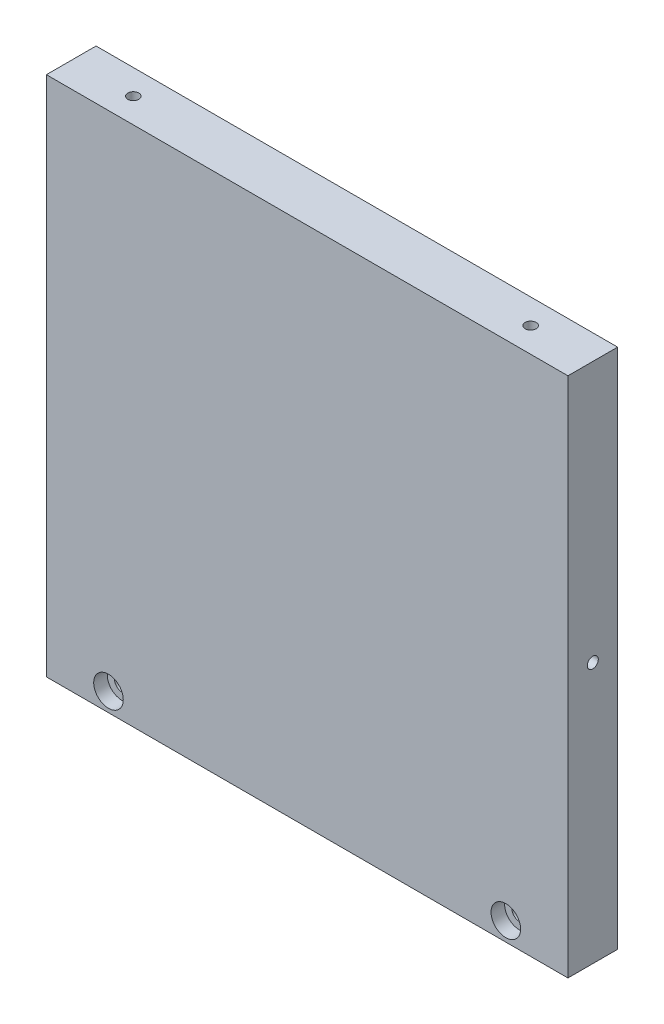
ISO-10303-21;
HEADER;
FILE_DESCRIPTION(('STEP AP214'),'2;1');
FILE_NAME('part.step','',(''),(''),'','','');
FILE_SCHEMA(('AUTOMOTIVE_DESIGN { 1 0 10303 214 1 1 1 1 }'));
ENDSEC;
DATA;
#1=APPLICATION_CONTEXT('core data for automotive mechanical design processes');
#2=APPLICATION_PROTOCOL_DEFINITION('international standard','automotive_design',2000,#1);
#3=PRODUCT_CONTEXT('',#1,'mechanical');
#4=PRODUCT('Part','Part','',(#3));
#5=PRODUCT_RELATED_PRODUCT_CATEGORY('part','',(#4));
#6=PRODUCT_DEFINITION_FORMATION('','',#4);
#7=PRODUCT_DEFINITION_CONTEXT('part definition',#1,'design');
#8=PRODUCT_DEFINITION('design','',#6,#7);
#9=PRODUCT_DEFINITION_SHAPE('','',#8);
#10=(LENGTH_UNIT() NAMED_UNIT(*) SI_UNIT(.MILLI.,.METRE.));
#11=(NAMED_UNIT(*) PLANE_ANGLE_UNIT() SI_UNIT($,.RADIAN.));
#12=(NAMED_UNIT(*) SI_UNIT($,.STERADIAN.) SOLID_ANGLE_UNIT());
#13=UNCERTAINTY_MEASURE_WITH_UNIT(LENGTH_MEASURE(1.E-05),#10,'distance_accuracy_value','');
#14=(GEOMETRIC_REPRESENTATION_CONTEXT(3) GLOBAL_UNCERTAINTY_ASSIGNED_CONTEXT((#13)) GLOBAL_UNIT_ASSIGNED_CONTEXT((#10,
#11,#12)) REPRESENTATION_CONTEXT('',''));
#15=CARTESIAN_POINT('',(0.,0.,0.));
#16=DIRECTION('',(0.,0.,1.));
#17=DIRECTION('',(1.,0.,0.));
#18=AXIS2_PLACEMENT_3D('',#15,#16,#17);
#19=CARTESIAN_POINT('',(42.,42.,8.));
#20=DIRECTION('',(-1.,0.,0.));
#21=DIRECTION('',(0.,0.,1.));
#22=AXIS2_PLACEMENT_3D('',#19,#20,#21);
#23=PLANE('',#22);
#24=CARTESIAN_POINT('',(42.,0.,4.));
#25=DIRECTION('',(1.,0.,0.));
#26=DIRECTION('',(0.,0.,-1.));
#27=AXIS2_PLACEMENT_3D('',#24,#25,#26);
#28=CIRCLE('',#27,0.888999999999989);
#29=CARTESIAN_POINT('',(42.,0.,3.11100000000001));
#30=VERTEX_POINT('',#29);
#31=EDGE_CURVE('E131',#30,#30,#28,.T.);
#32=ORIENTED_EDGE('',*,*,#31,.F.);
#33=EDGE_LOOP('',(#32));
#34=FACE_BOUND('',#33,.T.);
#35=DIRECTION('',(0.,1.,0.));
#36=VECTOR('',#35,1.);
#37=CARTESIAN_POINT('',(42.,42.,0.));
#38=LINE('',#37,#36);
#39=CARTESIAN_POINT('',(42.,-42.,0.));
#40=VERTEX_POINT('',#39);
#41=CARTESIAN_POINT('',(42.,42.,0.));
#42=VERTEX_POINT('',#41);
#43=EDGE_CURVE('E161',#40,#42,#38,.T.);
#44=ORIENTED_EDGE('',*,*,#43,.T.);
#45=DIRECTION('',(0.,0.,-1.));
#46=VECTOR('',#45,1.);
#47=CARTESIAN_POINT('',(42.,42.,8.));
#48=LINE('',#47,#46);
#49=CARTESIAN_POINT('',(42.,42.,8.));
#50=VERTEX_POINT('',#49);
#51=EDGE_CURVE('E11',#50,#42,#48,.T.);
#52=ORIENTED_EDGE('',*,*,#51,.F.);
#53=DIRECTION('',(0.,1.,0.));
#54=VECTOR('',#53,1.);
#55=CARTESIAN_POINT('',(42.,42.,8.));
#56=LINE('',#55,#54);
#57=CARTESIAN_POINT('',(42.,-42.,8.));
#58=VERTEX_POINT('',#57);
#59=EDGE_CURVE('E162',#58,#50,#56,.T.);
#60=ORIENTED_EDGE('',*,*,#59,.F.);
#61=DIRECTION('',(0.,0.,-1.));
#62=VECTOR('',#61,1.);
#63=CARTESIAN_POINT('',(42.,-42.,8.));
#64=LINE('',#63,#62);
#65=EDGE_CURVE('E168',#58,#40,#64,.T.);
#66=ORIENTED_EDGE('',*,*,#65,.T.);
#67=EDGE_LOOP('',(#44,#52,#60,#66));
#68=FACE_BOUND('',#67,.T.);
#69=ADVANCED_FACE('F44',(#34,#68),#23,.F.);
#70=CARTESIAN_POINT('',(-42.,42.,8.));
#71=DIRECTION('',(0.,-1.,0.));
#72=DIRECTION('',(0.,0.,-1.));
#73=AXIS2_PLACEMENT_3D('',#70,#71,#72);
#74=PLANE('',#73);
#75=CARTESIAN_POINT('',(-32.,42.,4.));
#76=DIRECTION('',(0.,1.,0.));
#77=DIRECTION('',(0.,0.,1.));
#78=AXIS2_PLACEMENT_3D('',#75,#76,#77);
#79=CIRCLE('',#78,0.888999999999987);
#80=CARTESIAN_POINT('',(-32.,42.,4.88899999999999));
#81=VERTEX_POINT('',#80);
#82=EDGE_CURVE('E115',#81,#81,#79,.T.);
#83=ORIENTED_EDGE('',*,*,#82,.F.);
#84=EDGE_LOOP('',(#83));
#85=FACE_BOUND('',#84,.T.);
#86=CARTESIAN_POINT('',(32.,42.,4.00000000000001));
#87=DIRECTION('',(0.,1.,0.));
#88=DIRECTION('',(0.,0.,1.));
#89=AXIS2_PLACEMENT_3D('',#86,#87,#88);
#90=CIRCLE('',#89,0.888999999999987);
#91=CARTESIAN_POINT('',(32.,42.,4.889));
#92=VERTEX_POINT('',#91);
#93=EDGE_CURVE('E114',#92,#92,#90,.T.);
#94=ORIENTED_EDGE('',*,*,#93,.F.);
#95=EDGE_LOOP('',(#94));
#96=FACE_BOUND('',#95,.T.);
#97=DIRECTION('',(-1.,0.,0.));
#98=VECTOR('',#97,1.);
#99=CARTESIAN_POINT('',(-42.,42.,0.));
#100=LINE('',#99,#98);
#101=CARTESIAN_POINT('',(-42.,42.,0.));
#102=VERTEX_POINT('',#101);
#103=EDGE_CURVE('E171',#42,#102,#100,.T.);
#104=ORIENTED_EDGE('',*,*,#103,.T.);
#105=DIRECTION('',(0.,0.,-1.));
#106=VECTOR('',#105,1.);
#107=CARTESIAN_POINT('',(-42.,42.,8.));
#108=LINE('',#107,#106);
#109=CARTESIAN_POINT('',(-42.,42.,8.));
#110=VERTEX_POINT('',#109);
#111=EDGE_CURVE('E52',#110,#102,#108,.T.);
#112=ORIENTED_EDGE('',*,*,#111,.F.);
#113=DIRECTION('',(-1.,0.,0.));
#114=VECTOR('',#113,1.);
#115=CARTESIAN_POINT('',(-42.,42.,8.));
#116=LINE('',#115,#114);
#117=EDGE_CURVE('E91',#50,#110,#116,.T.);
#118=ORIENTED_EDGE('',*,*,#117,.F.);
#119=ORIENTED_EDGE('',*,*,#51,.T.);
#120=EDGE_LOOP('',(#104,#112,#118,#119));
#121=FACE_BOUND('',#120,.T.);
#122=ADVANCED_FACE('F195',(#85,#96,#121),#74,.F.);
#123=CARTESIAN_POINT('',(-42.,42.,8.));
#124=DIRECTION('',(1.,0.,0.));
#125=DIRECTION('',(0.,0.,-1.));
#126=AXIS2_PLACEMENT_3D('',#123,#124,#125);
#127=PLANE('',#126);
#128=CARTESIAN_POINT('',(-42.,0.,4.));
#129=DIRECTION('',(-1.,0.,0.));
#130=DIRECTION('',(0.,0.,1.));
#131=AXIS2_PLACEMENT_3D('',#128,#129,#130);
#132=CIRCLE('',#131,0.888999999999989);
#133=CARTESIAN_POINT('',(-42.,0.,4.88899999999999));
#134=VERTEX_POINT('',#133);
#135=EDGE_CURVE('E125',#134,#134,#132,.T.);
#136=ORIENTED_EDGE('',*,*,#135,.F.);
#137=EDGE_LOOP('',(#136));
#138=FACE_BOUND('',#137,.T.);
#139=DIRECTION('',(0.,-1.,0.));
#140=VECTOR('',#139,1.);
#141=CARTESIAN_POINT('',(-42.,42.,0.));
#142=LINE('',#141,#140);
#143=CARTESIAN_POINT('',(-42.,-42.,0.));
#144=VERTEX_POINT('',#143);
#145=EDGE_CURVE('E78',#102,#144,#142,.T.);
#146=ORIENTED_EDGE('',*,*,#145,.T.);
#147=DIRECTION('',(0.,0.,-1.));
#148=VECTOR('',#147,1.);
#149=CARTESIAN_POINT('',(-42.,-42.,8.));
#150=LINE('',#149,#148);
#151=CARTESIAN_POINT('',(-42.,-42.,8.));
#152=VERTEX_POINT('',#151);
#153=EDGE_CURVE('E176',#152,#144,#150,.T.);
#154=ORIENTED_EDGE('',*,*,#153,.F.);
#155=DIRECTION('',(0.,-1.,0.));
#156=VECTOR('',#155,1.);
#157=CARTESIAN_POINT('',(-42.,42.,8.));
#158=LINE('',#157,#156);
#159=EDGE_CURVE('E165',#110,#152,#158,.T.);
#160=ORIENTED_EDGE('',*,*,#159,.F.);
#161=ORIENTED_EDGE('',*,*,#111,.T.);
#162=EDGE_LOOP('',(#146,#154,#160,#161));
#163=FACE_BOUND('',#162,.T.);
#164=ADVANCED_FACE('F178',(#138,#163),#127,.F.);
#165=CARTESIAN_POINT('',(-42.,-42.,8.));
#166=DIRECTION('',(0.,1.,0.));
#167=DIRECTION('',(0.,0.,1.));
#168=AXIS2_PLACEMENT_3D('',#165,#166,#167);
#169=PLANE('',#168);
#170=DIRECTION('',(1.,0.,0.));
#171=VECTOR('',#170,1.);
#172=CARTESIAN_POINT('',(-42.,-42.,0.));
#173=LINE('',#172,#171);
#174=EDGE_CURVE('E84',#144,#40,#173,.T.);
#175=ORIENTED_EDGE('',*,*,#174,.T.);
#176=ORIENTED_EDGE('',*,*,#65,.F.);
#177=DIRECTION('',(1.,0.,0.));
#178=VECTOR('',#177,1.);
#179=CARTESIAN_POINT('',(-42.,-42.,8.));
#180=LINE('',#179,#178);
#181=EDGE_CURVE('E60',#152,#58,#180,.T.);
#182=ORIENTED_EDGE('',*,*,#181,.F.);
#183=ORIENTED_EDGE('',*,*,#153,.T.);
#184=EDGE_LOOP('',(#175,#176,#182,#183));
#185=FACE_BOUND('',#184,.T.);
#186=ADVANCED_FACE('F185',(#185),#169,.F.);
#187=CARTESIAN_POINT('',(0.,0.,8.));
#188=DIRECTION('',(0.,0.,1.));
#189=DIRECTION('',(1.,0.,0.));
#190=AXIS2_PLACEMENT_3D('',#187,#188,#189);
#191=PLANE('',#190);
#192=CARTESIAN_POINT('',(-32.,-39.,8.));
#193=DIRECTION('',(0.,0.,1.));
#194=DIRECTION('',(1.,0.,0.));
#195=AXIS2_PLACEMENT_3D('',#192,#193,#194);
#196=CIRCLE('',#195,2.38124999999999);
#197=CARTESIAN_POINT('',(-29.61875,-39.,8.));
#198=VERTEX_POINT('',#197);
#199=EDGE_CURVE('E137',#198,#198,#196,.T.);
#200=ORIENTED_EDGE('',*,*,#199,.F.);
#201=EDGE_LOOP('',(#200));
#202=FACE_BOUND('',#201,.T.);
#203=CARTESIAN_POINT('',(32.,-39.,8.));
#204=DIRECTION('',(0.,0.,1.));
#205=DIRECTION('',(1.,0.,0.));
#206=AXIS2_PLACEMENT_3D('',#203,#204,#205);
#207=CIRCLE('',#206,2.38124999999999);
#208=CARTESIAN_POINT('',(34.38125,-39.,8.));
#209=VERTEX_POINT('',#208);
#210=EDGE_CURVE('E149',#209,#209,#207,.T.);
#211=ORIENTED_EDGE('',*,*,#210,.F.);
#212=EDGE_LOOP('',(#211));
#213=FACE_BOUND('',#212,.T.);
#214=ORIENTED_EDGE('',*,*,#59,.T.);
#215=ORIENTED_EDGE('',*,*,#117,.T.);
#216=ORIENTED_EDGE('',*,*,#159,.T.);
#217=ORIENTED_EDGE('',*,*,#181,.T.);
#218=EDGE_LOOP('',(#214,#215,#216,#217));
#219=FACE_BOUND('',#218,.T.);
#220=ADVANCED_FACE('F187',(#202,#213,#219),#191,.T.);
#221=CARTESIAN_POINT('',(0.,0.,0.));
#222=DIRECTION('',(0.,0.,1.));
#223=DIRECTION('',(1.,0.,0.));
#224=AXIS2_PLACEMENT_3D('',#221,#222,#223);
#225=PLANE('',#224);
#226=CARTESIAN_POINT('',(-32.,-39.,0.));
#227=DIRECTION('',(0.,0.,1.));
#228=DIRECTION('',(1.,0.,0.));
#229=AXIS2_PLACEMENT_3D('',#226,#227,#228);
#230=CIRCLE('',#229,1.2192);
#231=CARTESIAN_POINT('',(-30.7808,-39.,0.));
#232=VERTEX_POINT('',#231);
#233=EDGE_CURVE('E146',#232,#232,#230,.T.);
#234=ORIENTED_EDGE('',*,*,#233,.T.);
#235=EDGE_LOOP('',(#234));
#236=FACE_BOUND('',#235,.T.);
#237=CARTESIAN_POINT('',(32.,-39.,0.));
#238=DIRECTION('',(0.,0.,1.));
#239=DIRECTION('',(1.,0.,0.));
#240=AXIS2_PLACEMENT_3D('',#237,#238,#239);
#241=CIRCLE('',#240,1.2192);
#242=CARTESIAN_POINT('',(33.2192,-39.,0.));
#243=VERTEX_POINT('',#242);
#244=EDGE_CURVE('E158',#243,#243,#241,.T.);
#245=ORIENTED_EDGE('',*,*,#244,.T.);
#246=EDGE_LOOP('',(#245));
#247=FACE_BOUND('',#246,.T.);
#248=ORIENTED_EDGE('',*,*,#43,.F.);
#249=ORIENTED_EDGE('',*,*,#174,.F.);
#250=ORIENTED_EDGE('',*,*,#145,.F.);
#251=ORIENTED_EDGE('',*,*,#103,.F.);
#252=EDGE_LOOP('',(#248,#249,#250,#251));
#253=FACE_BOUND('',#252,.T.);
#254=ADVANCED_FACE('F181',(#236,#247,#253),#225,.F.);
#255=CARTESIAN_POINT('',(32.,-39.,8.));
#256=DIRECTION('',(0.,0.,1.));
#257=DIRECTION('',(1.,0.,0.));
#258=AXIS2_PLACEMENT_3D('',#255,#256,#257);
#259=CYLINDRICAL_SURFACE('',#258,1.2192);
#260=ORIENTED_EDGE('',*,*,#244,.F.);
#261=EDGE_LOOP('',(#260));
#262=FACE_BOUND('',#261,.T.);
#263=CARTESIAN_POINT('',(32.,-39.,5.8156));
#264=DIRECTION('',(0.,0.,1.));
#265=DIRECTION('',(1.,0.,0.));
#266=AXIS2_PLACEMENT_3D('',#263,#264,#265);
#267=CIRCLE('',#266,1.2192);
#268=CARTESIAN_POINT('',(33.2192,-39.,5.8156));
#269=VERTEX_POINT('',#268);
#270=EDGE_CURVE('E155',#269,#269,#267,.T.);
#271=ORIENTED_EDGE('',*,*,#270,.T.);
#272=EDGE_LOOP('',(#271));
#273=FACE_BOUND('',#272,.T.);
#274=ADVANCED_FACE('F244',(#262,#273),#259,.F.);
#275=CARTESIAN_POINT('',(33.2192,-39.,5.8156));
#276=DIRECTION('',(0.,0.,-1.));
#277=DIRECTION('',(-1.,0.,0.));
#278=AXIS2_PLACEMENT_3D('',#275,#276,#277);
#279=PLANE('',#278);
#280=ORIENTED_EDGE('',*,*,#270,.F.);
#281=EDGE_LOOP('',(#280));
#282=FACE_BOUND('',#281,.T.);
#283=CARTESIAN_POINT('',(32.,-39.,5.8156));
#284=DIRECTION('',(0.,0.,1.));
#285=DIRECTION('',(1.,0.,0.));
#286=AXIS2_PLACEMENT_3D('',#283,#284,#285);
#287=CIRCLE('',#286,2.38124999999999);
#288=CARTESIAN_POINT('',(34.38125,-39.,5.8156));
#289=VERTEX_POINT('',#288);
#290=EDGE_CURVE('E152',#289,#289,#287,.T.);
#291=ORIENTED_EDGE('',*,*,#290,.T.);
#292=EDGE_LOOP('',(#291));
#293=FACE_BOUND('',#292,.T.);
#294=ADVANCED_FACE('F240',(#282,#293),#279,.F.);
#295=CARTESIAN_POINT('',(32.,-39.,8.));
#296=DIRECTION('',(0.,0.,1.));
#297=DIRECTION('',(1.,0.,0.));
#298=AXIS2_PLACEMENT_3D('',#295,#296,#297);
#299=CYLINDRICAL_SURFACE('',#298,2.38124999999999);
#300=ORIENTED_EDGE('',*,*,#290,.F.);
#301=EDGE_LOOP('',(#300));
#302=FACE_BOUND('',#301,.T.);
#303=ORIENTED_EDGE('',*,*,#210,.T.);
#304=EDGE_LOOP('',(#303));
#305=FACE_BOUND('',#304,.T.);
#306=ADVANCED_FACE('F236',(#302,#305),#299,.F.);
#307=CARTESIAN_POINT('',(-32.,-39.,8.));
#308=DIRECTION('',(0.,0.,1.));
#309=DIRECTION('',(1.,0.,0.));
#310=AXIS2_PLACEMENT_3D('',#307,#308,#309);
#311=CYLINDRICAL_SURFACE('',#310,1.2192);
#312=ORIENTED_EDGE('',*,*,#233,.F.);
#313=EDGE_LOOP('',(#312));
#314=FACE_BOUND('',#313,.T.);
#315=CARTESIAN_POINT('',(-32.,-39.,5.8156));
#316=DIRECTION('',(0.,0.,1.));
#317=DIRECTION('',(1.,0.,0.));
#318=AXIS2_PLACEMENT_3D('',#315,#316,#317);
#319=CIRCLE('',#318,1.2192);
#320=CARTESIAN_POINT('',(-30.7808,-39.,5.8156));
#321=VERTEX_POINT('',#320);
#322=EDGE_CURVE('E143',#321,#321,#319,.T.);
#323=ORIENTED_EDGE('',*,*,#322,.T.);
#324=EDGE_LOOP('',(#323));
#325=FACE_BOUND('',#324,.T.);
#326=ADVANCED_FACE('F232',(#314,#325),#311,.F.);
#327=CARTESIAN_POINT('',(-30.7808,-39.,5.8156));
#328=DIRECTION('',(0.,0.,-1.));
#329=DIRECTION('',(-1.,0.,0.));
#330=AXIS2_PLACEMENT_3D('',#327,#328,#329);
#331=PLANE('',#330);
#332=ORIENTED_EDGE('',*,*,#322,.F.);
#333=EDGE_LOOP('',(#332));
#334=FACE_BOUND('',#333,.T.);
#335=CARTESIAN_POINT('',(-32.,-39.,5.8156));
#336=DIRECTION('',(0.,0.,1.));
#337=DIRECTION('',(1.,0.,0.));
#338=AXIS2_PLACEMENT_3D('',#335,#336,#337);
#339=CIRCLE('',#338,2.38124999999999);
#340=CARTESIAN_POINT('',(-29.61875,-39.,5.8156));
#341=VERTEX_POINT('',#340);
#342=EDGE_CURVE('E140',#341,#341,#339,.T.);
#343=ORIENTED_EDGE('',*,*,#342,.T.);
#344=EDGE_LOOP('',(#343));
#345=FACE_BOUND('',#344,.T.);
#346=ADVANCED_FACE('F228',(#334,#345),#331,.F.);
#347=CARTESIAN_POINT('',(-32.,-39.,8.));
#348=DIRECTION('',(0.,0.,1.));
#349=DIRECTION('',(1.,0.,0.));
#350=AXIS2_PLACEMENT_3D('',#347,#348,#349);
#351=CYLINDRICAL_SURFACE('',#350,2.38124999999999);
#352=ORIENTED_EDGE('',*,*,#342,.F.);
#353=EDGE_LOOP('',(#352));
#354=FACE_BOUND('',#353,.T.);
#355=ORIENTED_EDGE('',*,*,#199,.T.);
#356=EDGE_LOOP('',(#355));
#357=FACE_BOUND('',#356,.T.);
#358=ADVANCED_FACE('F220',(#354,#357),#351,.F.);
#359=CARTESIAN_POINT('',(30.,0.,4.));
#360=DIRECTION('',(1.,0.,0.));
#361=DIRECTION('',(0.,0.,-1.));
#362=AXIS2_PLACEMENT_3D('',#359,#360,#361);
#363=CONICAL_SURFACE('',#362,0.888999999999998,1.02974425867665);
#364=CARTESIAN_POINT('',(29.4658349096845,0.,4.));
#365=VERTEX_POINT('',#364);
#366=VERTEX_LOOP('',#365);
#367=FACE_BOUND('',#366,.T.);
#368=CARTESIAN_POINT('',(30.,0.,4.));
#369=DIRECTION('',(1.,0.,0.));
#370=DIRECTION('',(0.,0.,-1.));
#371=AXIS2_PLACEMENT_3D('',#368,#369,#370);
#372=CIRCLE('',#371,0.888999999999998);
#373=CARTESIAN_POINT('',(30.,0.,3.111));
#374=VERTEX_POINT('',#373);
#375=EDGE_CURVE('E134',#374,#374,#372,.T.);
#376=ORIENTED_EDGE('',*,*,#375,.T.);
#377=EDGE_LOOP('',(#376));
#378=FACE_BOUND('',#377,.T.);
#379=ADVANCED_FACE('F210',(#367,#378),#363,.F.);
#380=CARTESIAN_POINT('',(42.,0.,4.));
#381=DIRECTION('',(1.,0.,0.));
#382=DIRECTION('',(0.,0.,-1.));
#383=AXIS2_PLACEMENT_3D('',#380,#381,#382);
#384=CYLINDRICAL_SURFACE('',#383,0.888999999999993);
#385=ORIENTED_EDGE('',*,*,#375,.F.);
#386=EDGE_LOOP('',(#385));
#387=FACE_BOUND('',#386,.T.);
#388=ORIENTED_EDGE('',*,*,#31,.T.);
#389=EDGE_LOOP('',(#388));
#390=FACE_BOUND('',#389,.T.);
#391=ADVANCED_FACE('F207',(#387,#390),#384,.F.);
#392=CARTESIAN_POINT('',(-30.,0.,4.));
#393=DIRECTION('',(-1.,0.,0.));
#394=DIRECTION('',(0.,0.,1.));
#395=AXIS2_PLACEMENT_3D('',#392,#393,#394);
#396=CONICAL_SURFACE('',#395,0.888999999999997,1.02974425867665);
#397=CARTESIAN_POINT('',(-29.4658349096845,0.,4.));
#398=VERTEX_POINT('',#397);
#399=VERTEX_LOOP('',#398);
#400=FACE_BOUND('',#399,.T.);
#401=CARTESIAN_POINT('',(-30.,0.,4.));
#402=DIRECTION('',(-1.,0.,0.));
#403=DIRECTION('',(0.,0.,1.));
#404=AXIS2_PLACEMENT_3D('',#401,#402,#403);
#405=CIRCLE('',#404,0.888999999999997);
#406=CARTESIAN_POINT('',(-30.,0.,4.889));
#407=VERTEX_POINT('',#406);
#408=EDGE_CURVE('E128',#407,#407,#405,.T.);
#409=ORIENTED_EDGE('',*,*,#408,.T.);
#410=EDGE_LOOP('',(#409));
#411=FACE_BOUND('',#410,.T.);
#412=ADVANCED_FACE('F209',(#400,#411),#396,.F.);
#413=CARTESIAN_POINT('',(-42.,0.,4.));
#414=DIRECTION('',(-1.,0.,0.));
#415=DIRECTION('',(0.,0.,1.));
#416=AXIS2_PLACEMENT_3D('',#413,#414,#415);
#417=CYLINDRICAL_SURFACE('',#416,0.888999999999993);
#418=ORIENTED_EDGE('',*,*,#408,.F.);
#419=EDGE_LOOP('',(#418));
#420=FACE_BOUND('',#419,.T.);
#421=ORIENTED_EDGE('',*,*,#135,.T.);
#422=EDGE_LOOP('',(#421));
#423=FACE_BOUND('',#422,.T.);
#424=ADVANCED_FACE('F217',(#420,#423),#417,.F.);
#425=CARTESIAN_POINT('',(32.,30.,4.00000000000001));
#426=DIRECTION('',(0.,1.,0.));
#427=DIRECTION('',(0.,0.,1.));
#428=AXIS2_PLACEMENT_3D('',#425,#426,#427);
#429=CONICAL_SURFACE('',#428,0.888999999999994,1.02974425867665);
#430=CARTESIAN_POINT('',(32.,29.4658349096845,4.00000000000001));
#431=VERTEX_POINT('',#430);
#432=VERTEX_LOOP('',#431);
#433=FACE_BOUND('',#432,.T.);
#434=CARTESIAN_POINT('',(32.,30.,4.00000000000001));
#435=DIRECTION('',(0.,1.,0.));
#436=DIRECTION('',(0.,0.,1.));
#437=AXIS2_PLACEMENT_3D('',#434,#435,#436);
#438=CIRCLE('',#437,0.888999999999994);
#439=CARTESIAN_POINT('',(32.,30.,4.88900000000001));
#440=VERTEX_POINT('',#439);
#441=EDGE_CURVE('E118',#440,#440,#438,.T.);
#442=ORIENTED_EDGE('',*,*,#441,.T.);
#443=EDGE_LOOP('',(#442));
#444=FACE_BOUND('',#443,.T.);
#445=ADVANCED_FACE('F336',(#433,#444),#429,.F.);
#446=CARTESIAN_POINT('',(32.,42.,4.00000000000001));
#447=DIRECTION('',(0.,1.,0.));
#448=DIRECTION('',(0.,0.,1.));
#449=AXIS2_PLACEMENT_3D('',#446,#447,#448);
#450=CYLINDRICAL_SURFACE('',#449,0.88899999999999);
#451=ORIENTED_EDGE('',*,*,#441,.F.);
#452=EDGE_LOOP('',(#451));
#453=FACE_BOUND('',#452,.T.);
#454=ORIENTED_EDGE('',*,*,#93,.T.);
#455=EDGE_LOOP('',(#454));
#456=FACE_BOUND('',#455,.T.);
#457=ADVANCED_FACE('F108',(#453,#456),#450,.F.);
#458=CARTESIAN_POINT('',(-32.,30.,4.));
#459=DIRECTION('',(0.,1.,0.));
#460=DIRECTION('',(0.,0.,1.));
#461=AXIS2_PLACEMENT_3D('',#458,#459,#460);
#462=CONICAL_SURFACE('',#461,0.888999999999997,1.02974425867665);
#463=CARTESIAN_POINT('',(-32.,29.4658349096845,4.));
#464=VERTEX_POINT('',#463);
#465=VERTEX_LOOP('',#464);
#466=FACE_BOUND('',#465,.T.);
#467=CARTESIAN_POINT('',(-32.,30.,4.));
#468=DIRECTION('',(0.,1.,0.));
#469=DIRECTION('',(0.,0.,1.));
#470=AXIS2_PLACEMENT_3D('',#467,#468,#469);
#471=CIRCLE('',#470,0.888999999999997);
#472=CARTESIAN_POINT('',(-32.,30.,4.889));
#473=VERTEX_POINT('',#472);
#474=EDGE_CURVE('E112',#473,#473,#471,.T.);
#475=ORIENTED_EDGE('',*,*,#474,.T.);
#476=EDGE_LOOP('',(#475));
#477=FACE_BOUND('',#476,.T.);
#478=ADVANCED_FACE('F104',(#466,#477),#462,.F.);
#479=CARTESIAN_POINT('',(-32.,42.,4.));
#480=DIRECTION('',(0.,1.,0.));
#481=DIRECTION('',(0.,0.,1.));
#482=AXIS2_PLACEMENT_3D('',#479,#480,#481);
#483=CYLINDRICAL_SURFACE('',#482,0.888999999999992);
#484=ORIENTED_EDGE('',*,*,#474,.F.);
#485=EDGE_LOOP('',(#484));
#486=FACE_BOUND('',#485,.T.);
#487=ORIENTED_EDGE('',*,*,#82,.T.);
#488=EDGE_LOOP('',(#487));
#489=FACE_BOUND('',#488,.T.);
#490=ADVANCED_FACE('F107',(#486,#489),#483,.F.);
#491=CLOSED_SHELL('',(#69,#122,#164,#186,#220,#254,#274,#294,#306,#326,#346,#358,#379,#391,#412,
#424,#445,#457,#478,#490));
#492=MANIFOLD_SOLID_BREP('B2',#491);
#493=ADVANCED_BREP_SHAPE_REPRESENTATION('',(#18,#492),#14);
#494=SHAPE_DEFINITION_REPRESENTATION(#9,#493);
ENDSEC;
END-ISO-10303-21;
